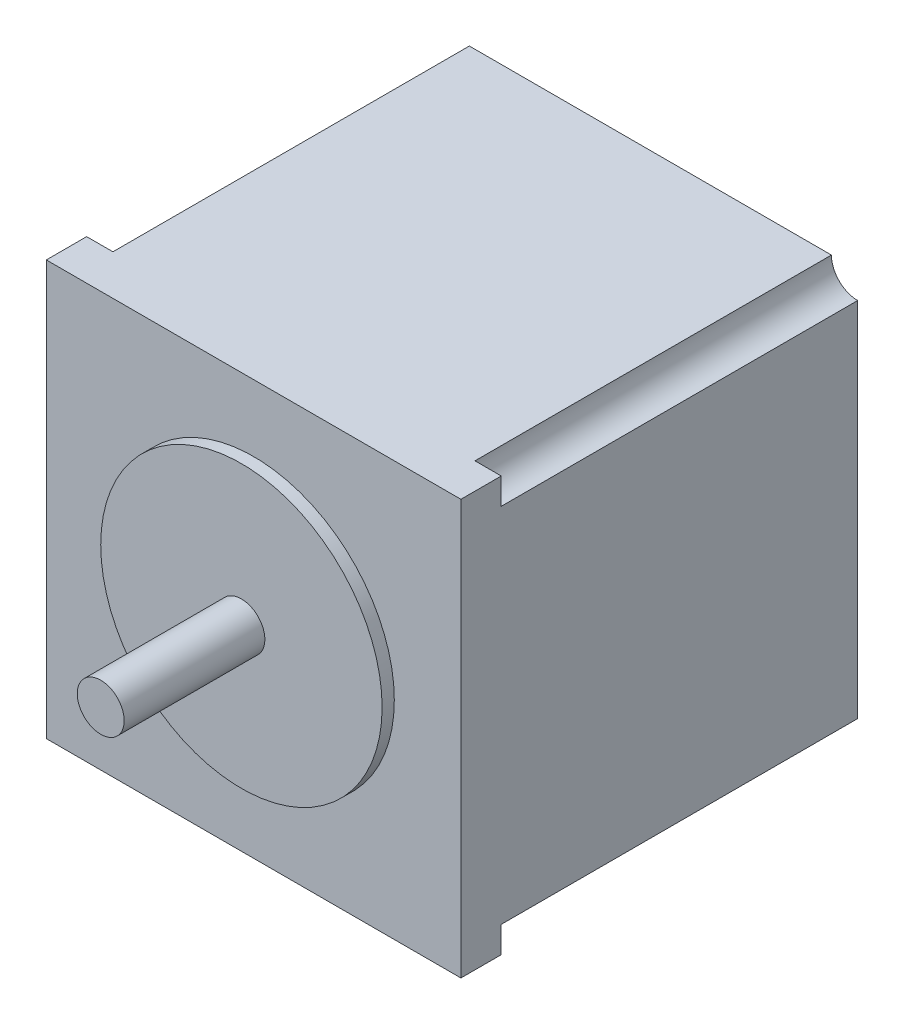
ISO-10303-21;
HEADER;
FILE_DESCRIPTION(('STEP AP214'),'2;1');
FILE_NAME('part.step','',(''),(''),'','','');
FILE_SCHEMA(('AUTOMOTIVE_DESIGN { 1 0 10303 214 1 1 1 1 }'));
ENDSEC;
DATA;
#1=APPLICATION_CONTEXT('core data for automotive mechanical design processes');
#2=APPLICATION_PROTOCOL_DEFINITION('international standard','automotive_design',2000,#1);
#3=PRODUCT_CONTEXT('',#1,'mechanical');
#4=PRODUCT('Part','Part','',(#3));
#5=PRODUCT_RELATED_PRODUCT_CATEGORY('part','',(#4));
#6=PRODUCT_DEFINITION_FORMATION('','',#4);
#7=PRODUCT_DEFINITION_CONTEXT('part definition',#1,'design');
#8=PRODUCT_DEFINITION('design','',#6,#7);
#9=PRODUCT_DEFINITION_SHAPE('','',#8);
#10=(LENGTH_UNIT() NAMED_UNIT(*) SI_UNIT(.MILLI.,.METRE.));
#11=(NAMED_UNIT(*) PLANE_ANGLE_UNIT() SI_UNIT($,.RADIAN.));
#12=(NAMED_UNIT(*) SI_UNIT($,.STERADIAN.) SOLID_ANGLE_UNIT());
#13=UNCERTAINTY_MEASURE_WITH_UNIT(LENGTH_MEASURE(1.E-05),#10,'distance_accuracy_value','');
#14=(GEOMETRIC_REPRESENTATION_CONTEXT(3) GLOBAL_UNCERTAINTY_ASSIGNED_CONTEXT((#13)) GLOBAL_UNIT_ASSIGNED_CONTEXT((#10,
#11,#12)) REPRESENTATION_CONTEXT('',''));
#15=CARTESIAN_POINT('',(0.,0.,0.));
#16=DIRECTION('',(0.,0.,1.));
#17=DIRECTION('',(1.,0.,0.));
#18=AXIS2_PLACEMENT_3D('',#15,#16,#17);
#19=CARTESIAN_POINT('',(0.,0.,0.));
#20=DIRECTION('',(0.,0.,-1.));
#21=DIRECTION('',(-1.,0.,0.));
#22=AXIS2_PLACEMENT_3D('',#19,#20,#21);
#23=PLANE('',#22);
#24=CARTESIAN_POINT('',(0.,56.134,0.));
#25=DIRECTION('',(0.,0.,1.));
#26=DIRECTION('',(-1.,0.,0.));
#27=AXIS2_PLACEMENT_3D('',#24,#25,#26);
#28=CIRCLE('',#27,3.556);
#29=CARTESIAN_POINT('',(0.,52.578,0.));
#30=VERTEX_POINT('',#29);
#31=CARTESIAN_POINT('',(3.556,56.134,0.));
#32=VERTEX_POINT('',#31);
#33=EDGE_CURVE('E157',#30,#32,#28,.T.);
#34=ORIENTED_EDGE('',*,*,#33,.F.);
#35=DIRECTION('',(0.,-1.,0.));
#36=VECTOR('',#35,1.);
#37=CARTESIAN_POINT('',(0.,0.,0.));
#38=LINE('',#37,#36);
#39=CARTESIAN_POINT('',(0.,56.134,0.));
#40=VERTEX_POINT('',#39);
#41=EDGE_CURVE('E188',#40,#30,#38,.T.);
#42=ORIENTED_EDGE('',*,*,#41,.F.);
#43=DIRECTION('',(-1.,0.,0.));
#44=VECTOR('',#43,1.);
#45=CARTESIAN_POINT('',(0.,56.134,0.));
#46=LINE('',#45,#44);
#47=EDGE_CURVE('E200',#32,#40,#46,.T.);
#48=ORIENTED_EDGE('',*,*,#47,.F.);
#49=EDGE_LOOP('',(#34,#42,#48));
#50=FACE_BOUND('',#49,.T.);
#51=ADVANCED_FACE('F39',(#50),#23,.T.);
#52=CARTESIAN_POINT('',(0.,0.,0.));
#53=DIRECTION('',(0.,0.,1.));
#54=DIRECTION('',(-1.,0.,0.));
#55=AXIS2_PLACEMENT_3D('',#52,#53,#54);
#56=CIRCLE('',#55,3.556);
#57=CARTESIAN_POINT('',(3.556,0.,0.));
#58=VERTEX_POINT('',#57);
#59=CARTESIAN_POINT('',(0.,3.556,0.));
#60=VERTEX_POINT('',#59);
#61=EDGE_CURVE('E65',#58,#60,#56,.T.);
#62=ORIENTED_EDGE('',*,*,#61,.F.);
#63=DIRECTION('',(1.,0.,0.));
#64=VECTOR('',#63,1.);
#65=CARTESIAN_POINT('',(0.,0.,0.));
#66=LINE('',#65,#64);
#67=CARTESIAN_POINT('',(0.,0.,0.));
#68=VERTEX_POINT('',#67);
#69=EDGE_CURVE('E192',#68,#58,#66,.T.);
#70=ORIENTED_EDGE('',*,*,#69,.F.);
#71=EDGE_CURVE('E164',#60,#68,#38,.T.);
#72=ORIENTED_EDGE('',*,*,#71,.F.);
#73=EDGE_LOOP('',(#62,#70,#72));
#74=FACE_BOUND('',#73,.T.);
#75=ADVANCED_FACE('F228',(#74),#23,.T.);
#76=CARTESIAN_POINT('',(56.134,0.,0.));
#77=DIRECTION('',(0.,0.,1.));
#78=DIRECTION('',(-1.,0.,0.));
#79=AXIS2_PLACEMENT_3D('',#76,#77,#78);
#80=CIRCLE('',#79,3.556);
#81=CARTESIAN_POINT('',(56.134,3.556,0.));
#82=VERTEX_POINT('',#81);
#83=CARTESIAN_POINT('',(52.578,0.,0.));
#84=VERTEX_POINT('',#83);
#85=EDGE_CURVE('E263',#82,#84,#80,.T.);
#86=ORIENTED_EDGE('',*,*,#85,.F.);
#87=DIRECTION('',(0.,1.,0.));
#88=VECTOR('',#87,1.);
#89=CARTESIAN_POINT('',(56.134,0.,0.));
#90=LINE('',#89,#88);
#91=CARTESIAN_POINT('',(56.134,0.,0.));
#92=VERTEX_POINT('',#91);
#93=EDGE_CURVE('E196',#92,#82,#90,.T.);
#94=ORIENTED_EDGE('',*,*,#93,.F.);
#95=EDGE_CURVE('E57',#84,#92,#66,.T.);
#96=ORIENTED_EDGE('',*,*,#95,.F.);
#97=EDGE_LOOP('',(#86,#94,#96));
#98=FACE_BOUND('',#97,.T.);
#99=ADVANCED_FACE('F230',(#98),#23,.T.);
#100=CARTESIAN_POINT('',(56.134,56.134,0.));
#101=DIRECTION('',(0.,0.,1.));
#102=DIRECTION('',(-1.,0.,0.));
#103=AXIS2_PLACEMENT_3D('',#100,#101,#102);
#104=CIRCLE('',#103,3.556);
#105=CARTESIAN_POINT('',(52.578,56.134,0.));
#106=VERTEX_POINT('',#105);
#107=CARTESIAN_POINT('',(56.134,52.578,0.));
#108=VERTEX_POINT('',#107);
#109=EDGE_CURVE('E258',#106,#108,#104,.T.);
#110=ORIENTED_EDGE('',*,*,#109,.F.);
#111=CARTESIAN_POINT('',(56.134,56.134,0.));
#112=VERTEX_POINT('',#111);
#113=EDGE_CURVE('E178',#112,#106,#46,.T.);
#114=ORIENTED_EDGE('',*,*,#113,.F.);
#115=EDGE_CURVE('E195',#108,#112,#90,.T.);
#116=ORIENTED_EDGE('',*,*,#115,.F.);
#117=EDGE_LOOP('',(#110,#114,#116));
#118=FACE_BOUND('',#117,.T.);
#119=ADVANCED_FACE('F236',(#118),#23,.T.);
#120=CARTESIAN_POINT('',(0.,0.,5.461));
#121=DIRECTION('',(1.,0.,0.));
#122=DIRECTION('',(0.,0.,-1.));
#123=AXIS2_PLACEMENT_3D('',#120,#121,#122);
#124=PLANE('',#123);
#125=ORIENTED_EDGE('',*,*,#41,.T.);
#126=DIRECTION('',(0.,0.,1.));
#127=VECTOR('',#126,1.);
#128=CARTESIAN_POINT('',(0.,52.578,-48.26));
#129=LINE('',#128,#127);
#130=CARTESIAN_POINT('',(0.,52.578,-48.26));
#131=VERTEX_POINT('',#130);
#132=EDGE_CURVE('E286',#131,#30,#129,.T.);
#133=ORIENTED_EDGE('',*,*,#132,.F.);
#134=DIRECTION('',(0.,1.,0.));
#135=VECTOR('',#134,1.);
#136=CARTESIAN_POINT('',(0.,52.578,-48.26));
#137=LINE('',#136,#135);
#138=CARTESIAN_POINT('',(0.,3.556,-48.26));
#139=VERTEX_POINT('',#138);
#140=EDGE_CURVE('E150',#139,#131,#137,.T.);
#141=ORIENTED_EDGE('',*,*,#140,.F.);
#142=DIRECTION('',(0.,0.,1.));
#143=VECTOR('',#142,1.);
#144=CARTESIAN_POINT('',(0.,3.556,-48.26));
#145=LINE('',#144,#143);
#146=EDGE_CURVE('E226',#139,#60,#145,.T.);
#147=ORIENTED_EDGE('',*,*,#146,.T.);
#148=ORIENTED_EDGE('',*,*,#71,.T.);
#149=DIRECTION('',(0.,0.,-1.));
#150=VECTOR('',#149,1.);
#151=CARTESIAN_POINT('',(0.,0.,5.461));
#152=LINE('',#151,#150);
#153=CARTESIAN_POINT('',(0.,0.,5.461));
#154=VERTEX_POINT('',#153);
#155=EDGE_CURVE('E43',#154,#68,#152,.T.);
#156=ORIENTED_EDGE('',*,*,#155,.F.);
#157=DIRECTION('',(0.,-1.,0.));
#158=VECTOR('',#157,1.);
#159=CARTESIAN_POINT('',(0.,0.,5.461));
#160=LINE('',#159,#158);
#161=CARTESIAN_POINT('',(0.,56.134,5.461));
#162=VERTEX_POINT('',#161);
#163=EDGE_CURVE('E173',#162,#154,#160,.T.);
#164=ORIENTED_EDGE('',*,*,#163,.F.);
#165=DIRECTION('',(0.,0.,-1.));
#166=VECTOR('',#165,1.);
#167=CARTESIAN_POINT('',(0.,56.134,5.461));
#168=LINE('',#167,#166);
#169=EDGE_CURVE('E187',#162,#40,#168,.T.);
#170=ORIENTED_EDGE('',*,*,#169,.T.);
#171=EDGE_LOOP('',(#125,#133,#141,#147,#148,#156,#164,#170));
#172=FACE_BOUND('',#171,.T.);
#173=ADVANCED_FACE('F41',(#172),#124,.F.);
#174=CARTESIAN_POINT('',(0.,0.,5.461));
#175=DIRECTION('',(0.,1.,0.));
#176=DIRECTION('',(0.,0.,1.));
#177=AXIS2_PLACEMENT_3D('',#174,#175,#176);
#178=PLANE('',#177);
#179=ORIENTED_EDGE('',*,*,#69,.T.);
#180=DIRECTION('',(0.,0.,1.));
#181=VECTOR('',#180,1.);
#182=CARTESIAN_POINT('',(3.556,0.,-48.26));
#183=LINE('',#182,#181);
#184=CARTESIAN_POINT('',(3.556,0.,-48.26));
#185=VERTEX_POINT('',#184);
#186=EDGE_CURVE('E298',#185,#58,#183,.T.);
#187=ORIENTED_EDGE('',*,*,#186,.F.);
#188=DIRECTION('',(-1.,0.,0.));
#189=VECTOR('',#188,1.);
#190=CARTESIAN_POINT('',(52.578,0.,-48.26));
#191=LINE('',#190,#189);
#192=CARTESIAN_POINT('',(52.578,0.,-48.26));
#193=VERTEX_POINT('',#192);
#194=EDGE_CURVE('E278',#193,#185,#191,.T.);
#195=ORIENTED_EDGE('',*,*,#194,.F.);
#196=DIRECTION('',(0.,0.,1.));
#197=VECTOR('',#196,1.);
#198=CARTESIAN_POINT('',(52.578,0.,-48.26));
#199=LINE('',#198,#197);
#200=EDGE_CURVE('E301',#193,#84,#199,.T.);
#201=ORIENTED_EDGE('',*,*,#200,.T.);
#202=ORIENTED_EDGE('',*,*,#95,.T.);
#203=DIRECTION('',(0.,0.,-1.));
#204=VECTOR('',#203,1.);
#205=CARTESIAN_POINT('',(56.134,0.,5.461));
#206=LINE('',#205,#204);
#207=CARTESIAN_POINT('',(56.134,0.,5.461));
#208=VERTEX_POINT('',#207);
#209=EDGE_CURVE('E209',#208,#92,#206,.T.);
#210=ORIENTED_EDGE('',*,*,#209,.F.);
#211=DIRECTION('',(1.,0.,0.));
#212=VECTOR('',#211,1.);
#213=CARTESIAN_POINT('',(0.,0.,5.461));
#214=LINE('',#213,#212);
#215=EDGE_CURVE('E177',#154,#208,#214,.T.);
#216=ORIENTED_EDGE('',*,*,#215,.F.);
#217=ORIENTED_EDGE('',*,*,#155,.T.);
#218=EDGE_LOOP('',(#179,#187,#195,#201,#202,#210,#216,#217));
#219=FACE_BOUND('',#218,.T.);
#220=ADVANCED_FACE('F219',(#219),#178,.F.);
#221=CARTESIAN_POINT('',(56.134,0.,5.461));
#222=DIRECTION('',(-1.,0.,0.));
#223=DIRECTION('',(0.,0.,1.));
#224=AXIS2_PLACEMENT_3D('',#221,#222,#223);
#225=PLANE('',#224);
#226=ORIENTED_EDGE('',*,*,#93,.T.);
#227=DIRECTION('',(0.,0.,1.));
#228=VECTOR('',#227,1.);
#229=CARTESIAN_POINT('',(56.134,3.556,-48.26));
#230=LINE('',#229,#228);
#231=CARTESIAN_POINT('',(56.134,3.556,-48.26));
#232=VERTEX_POINT('',#231);
#233=EDGE_CURVE('E305',#232,#82,#230,.T.);
#234=ORIENTED_EDGE('',*,*,#233,.F.);
#235=DIRECTION('',(0.,-1.,0.));
#236=VECTOR('',#235,1.);
#237=CARTESIAN_POINT('',(56.134,52.578,-48.26));
#238=LINE('',#237,#236);
#239=CARTESIAN_POINT('',(56.134,52.578,-48.26));
#240=VERTEX_POINT('',#239);
#241=EDGE_CURVE('E270',#240,#232,#238,.T.);
#242=ORIENTED_EDGE('',*,*,#241,.F.);
#243=DIRECTION('',(0.,0.,1.));
#244=VECTOR('',#243,1.);
#245=CARTESIAN_POINT('',(56.134,52.578,-48.26));
#246=LINE('',#245,#244);
#247=EDGE_CURVE('E166',#240,#108,#246,.T.);
#248=ORIENTED_EDGE('',*,*,#247,.T.);
#249=ORIENTED_EDGE('',*,*,#115,.T.);
#250=DIRECTION('',(0.,0.,-1.));
#251=VECTOR('',#250,1.);
#252=CARTESIAN_POINT('',(56.134,56.134,5.461));
#253=LINE('',#252,#251);
#254=CARTESIAN_POINT('',(56.134,56.134,5.461));
#255=VERTEX_POINT('',#254);
#256=EDGE_CURVE('E206',#255,#112,#253,.T.);
#257=ORIENTED_EDGE('',*,*,#256,.F.);
#258=DIRECTION('',(0.,1.,0.));
#259=VECTOR('',#258,1.);
#260=CARTESIAN_POINT('',(56.134,0.,5.461));
#261=LINE('',#260,#259);
#262=EDGE_CURVE('E181',#208,#255,#261,.T.);
#263=ORIENTED_EDGE('',*,*,#262,.F.);
#264=ORIENTED_EDGE('',*,*,#209,.T.);
#265=EDGE_LOOP('',(#226,#234,#242,#248,#249,#257,#263,#264));
#266=FACE_BOUND('',#265,.T.);
#267=ADVANCED_FACE('F244',(#266),#225,.F.);
#268=CARTESIAN_POINT('',(0.,56.134,5.461));
#269=DIRECTION('',(0.,-1.,0.));
#270=DIRECTION('',(0.,0.,-1.));
#271=AXIS2_PLACEMENT_3D('',#268,#269,#270);
#272=PLANE('',#271);
#273=ORIENTED_EDGE('',*,*,#113,.T.);
#274=DIRECTION('',(0.,0.,1.));
#275=VECTOR('',#274,1.);
#276=CARTESIAN_POINT('',(52.578,56.134,-48.26));
#277=LINE('',#276,#275);
#278=CARTESIAN_POINT('',(52.578,56.134,-48.26));
#279=VERTEX_POINT('',#278);
#280=EDGE_CURVE('E140',#279,#106,#277,.T.);
#281=ORIENTED_EDGE('',*,*,#280,.F.);
#282=DIRECTION('',(1.,0.,0.));
#283=VECTOR('',#282,1.);
#284=CARTESIAN_POINT('',(52.578,56.134,-48.26));
#285=LINE('',#284,#283);
#286=CARTESIAN_POINT('',(3.556,56.134,-48.26));
#287=VERTEX_POINT('',#286);
#288=EDGE_CURVE('E132',#287,#279,#285,.T.);
#289=ORIENTED_EDGE('',*,*,#288,.F.);
#290=DIRECTION('',(0.,0.,1.));
#291=VECTOR('',#290,1.);
#292=CARTESIAN_POINT('',(3.556,56.134,-48.26));
#293=LINE('',#292,#291);
#294=EDGE_CURVE('E137',#287,#32,#293,.T.);
#295=ORIENTED_EDGE('',*,*,#294,.T.);
#296=ORIENTED_EDGE('',*,*,#47,.T.);
#297=ORIENTED_EDGE('',*,*,#169,.F.);
#298=DIRECTION('',(-1.,0.,0.));
#299=VECTOR('',#298,1.);
#300=CARTESIAN_POINT('',(0.,56.134,5.461));
#301=LINE('',#300,#299);
#302=EDGE_CURVE('E184',#255,#162,#301,.T.);
#303=ORIENTED_EDGE('',*,*,#302,.F.);
#304=ORIENTED_EDGE('',*,*,#256,.T.);
#305=EDGE_LOOP('',(#273,#281,#289,#295,#296,#297,#303,#304));
#306=FACE_BOUND('',#305,.T.);
#307=ADVANCED_FACE('F135',(#306),#272,.F.);
#308=CARTESIAN_POINT('',(0.,0.,5.461));
#309=DIRECTION('',(0.,0.,-1.));
#310=DIRECTION('',(-1.,0.,0.));
#311=AXIS2_PLACEMENT_3D('',#308,#309,#310);
#312=PLANE('',#311);
#313=CARTESIAN_POINT('',(28.067,28.067,5.461));
#314=DIRECTION('',(0.,0.,1.));
#315=DIRECTION('',(1.,0.,0.));
#316=AXIS2_PLACEMENT_3D('',#313,#314,#315);
#317=CIRCLE('',#316,19.05);
#318=CARTESIAN_POINT('',(47.117,28.067,5.461));
#319=VERTEX_POINT('',#318);
#320=EDGE_CURVE('E49',#319,#319,#317,.T.);
#321=ORIENTED_EDGE('',*,*,#320,.F.);
#322=EDGE_LOOP('',(#321));
#323=FACE_BOUND('',#322,.T.);
#324=ORIENTED_EDGE('',*,*,#163,.T.);
#325=ORIENTED_EDGE('',*,*,#215,.T.);
#326=ORIENTED_EDGE('',*,*,#262,.T.);
#327=ORIENTED_EDGE('',*,*,#302,.T.);
#328=EDGE_LOOP('',(#324,#325,#326,#327));
#329=FACE_BOUND('',#328,.T.);
#330=ADVANCED_FACE('F240',(#323,#329),#312,.F.);
#331=CARTESIAN_POINT('',(28.067,28.067,7.112));
#332=DIRECTION('',(0.,0.,-1.));
#333=DIRECTION('',(-1.,0.,0.));
#334=AXIS2_PLACEMENT_3D('',#331,#332,#333);
#335=CYLINDRICAL_SURFACE('',#334,19.05);
#336=CARTESIAN_POINT('',(28.067,28.067,7.112));
#337=DIRECTION('',(0.,0.,1.));
#338=DIRECTION('',(1.,0.,0.));
#339=AXIS2_PLACEMENT_3D('',#336,#337,#338);
#340=CIRCLE('',#339,19.05);
#341=CARTESIAN_POINT('',(47.117,28.067,7.112));
#342=VERTEX_POINT('',#341);
#343=EDGE_CURVE('E159',#342,#342,#340,.T.);
#344=ORIENTED_EDGE('',*,*,#343,.F.);
#345=EDGE_LOOP('',(#344));
#346=FACE_BOUND('',#345,.T.);
#347=ORIENTED_EDGE('',*,*,#320,.T.);
#348=EDGE_LOOP('',(#347));
#349=FACE_BOUND('',#348,.T.);
#350=ADVANCED_FACE('F325',(#346,#349),#335,.T.);
#351=CARTESIAN_POINT('',(28.067,28.067,7.112));
#352=DIRECTION('',(0.,0.,1.));
#353=DIRECTION('',(1.,0.,0.));
#354=AXIS2_PLACEMENT_3D('',#351,#352,#353);
#355=PLANE('',#354);
#356=CARTESIAN_POINT('',(28.067,28.067,7.112));
#357=DIRECTION('',(0.,0.,1.));
#358=DIRECTION('',(1.,0.,0.));
#359=AXIS2_PLACEMENT_3D('',#356,#357,#358);
#360=CIRCLE('',#359,3.175);
#361=CARTESIAN_POINT('',(31.242,28.067,7.112));
#362=VERTEX_POINT('',#361);
#363=EDGE_CURVE('E11',#362,#362,#360,.T.);
#364=ORIENTED_EDGE('',*,*,#363,.F.);
#365=EDGE_LOOP('',(#364));
#366=FACE_BOUND('',#365,.T.);
#367=ORIENTED_EDGE('',*,*,#343,.T.);
#368=EDGE_LOOP('',(#367));
#369=FACE_BOUND('',#368,.T.);
#370=ADVANCED_FACE('F330',(#366,#369),#355,.T.);
#371=CARTESIAN_POINT('',(0.,56.134,-48.26));
#372=DIRECTION('',(0.,0.,1.));
#373=DIRECTION('',(1.,0.,0.));
#374=AXIS2_PLACEMENT_3D('',#371,#372,#373);
#375=CYLINDRICAL_SURFACE('',#374,3.556);
#376=ORIENTED_EDGE('',*,*,#33,.T.);
#377=ORIENTED_EDGE('',*,*,#294,.F.);
#378=CARTESIAN_POINT('',(0.,56.134,-48.26));
#379=DIRECTION('',(0.,0.,1.));
#380=DIRECTION('',(-1.,0.,0.));
#381=AXIS2_PLACEMENT_3D('',#378,#379,#380);
#382=CIRCLE('',#381,3.556);
#383=EDGE_CURVE('E145',#131,#287,#382,.T.);
#384=ORIENTED_EDGE('',*,*,#383,.F.);
#385=ORIENTED_EDGE('',*,*,#132,.T.);
#386=EDGE_LOOP('',(#376,#377,#384,#385));
#387=FACE_BOUND('',#386,.T.);
#388=ADVANCED_FACE('F156',(#387),#375,.F.);
#389=CARTESIAN_POINT('',(56.134,56.134,-48.26));
#390=DIRECTION('',(0.,0.,1.));
#391=DIRECTION('',(1.,0.,0.));
#392=AXIS2_PLACEMENT_3D('',#389,#390,#391);
#393=CYLINDRICAL_SURFACE('',#392,3.556);
#394=ORIENTED_EDGE('',*,*,#109,.T.);
#395=ORIENTED_EDGE('',*,*,#247,.F.);
#396=CARTESIAN_POINT('',(56.134,56.134,-48.26));
#397=DIRECTION('',(0.,0.,1.));
#398=DIRECTION('',(-1.,0.,0.));
#399=AXIS2_PLACEMENT_3D('',#396,#397,#398);
#400=CIRCLE('',#399,3.556);
#401=EDGE_CURVE('E144',#279,#240,#400,.T.);
#402=ORIENTED_EDGE('',*,*,#401,.F.);
#403=ORIENTED_EDGE('',*,*,#280,.T.);
#404=EDGE_LOOP('',(#394,#395,#402,#403));
#405=FACE_BOUND('',#404,.T.);
#406=ADVANCED_FACE('F267',(#405),#393,.F.);
#407=CARTESIAN_POINT('',(56.134,0.,-48.26));
#408=DIRECTION('',(0.,0.,1.));
#409=DIRECTION('',(1.,0.,0.));
#410=AXIS2_PLACEMENT_3D('',#407,#408,#409);
#411=CYLINDRICAL_SURFACE('',#410,3.556);
#412=ORIENTED_EDGE('',*,*,#85,.T.);
#413=ORIENTED_EDGE('',*,*,#200,.F.);
#414=CARTESIAN_POINT('',(56.134,0.,-48.26));
#415=DIRECTION('',(0.,0.,1.));
#416=DIRECTION('',(-1.,0.,0.));
#417=AXIS2_PLACEMENT_3D('',#414,#415,#416);
#418=CIRCLE('',#417,3.556);
#419=EDGE_CURVE('E273',#232,#193,#418,.T.);
#420=ORIENTED_EDGE('',*,*,#419,.F.);
#421=ORIENTED_EDGE('',*,*,#233,.T.);
#422=EDGE_LOOP('',(#412,#413,#420,#421));
#423=FACE_BOUND('',#422,.T.);
#424=ADVANCED_FACE('F314',(#423),#411,.F.);
#425=CARTESIAN_POINT('',(0.,0.,-48.26));
#426=DIRECTION('',(0.,0.,1.));
#427=DIRECTION('',(1.,0.,0.));
#428=AXIS2_PLACEMENT_3D('',#425,#426,#427);
#429=CYLINDRICAL_SURFACE('',#428,3.556);
#430=ORIENTED_EDGE('',*,*,#61,.T.);
#431=ORIENTED_EDGE('',*,*,#146,.F.);
#432=CARTESIAN_POINT('',(0.,0.,-48.26));
#433=DIRECTION('',(0.,0.,1.));
#434=DIRECTION('',(-1.,0.,0.));
#435=AXIS2_PLACEMENT_3D('',#432,#433,#434);
#436=CIRCLE('',#435,3.556);
#437=EDGE_CURVE('E281',#185,#139,#436,.T.);
#438=ORIENTED_EDGE('',*,*,#437,.F.);
#439=ORIENTED_EDGE('',*,*,#186,.T.);
#440=EDGE_LOOP('',(#430,#431,#438,#439));
#441=FACE_BOUND('',#440,.T.);
#442=ADVANCED_FACE('F317',(#441),#429,.F.);
#443=CARTESIAN_POINT('',(0.,56.134,-48.26));
#444=DIRECTION('',(0.,0.,-1.));
#445=DIRECTION('',(-1.,0.,0.));
#446=AXIS2_PLACEMENT_3D('',#443,#444,#445);
#447=PLANE('',#446);
#448=ORIENTED_EDGE('',*,*,#383,.T.);
#449=ORIENTED_EDGE('',*,*,#288,.T.);
#450=ORIENTED_EDGE('',*,*,#401,.T.);
#451=ORIENTED_EDGE('',*,*,#241,.T.);
#452=ORIENTED_EDGE('',*,*,#419,.T.);
#453=ORIENTED_EDGE('',*,*,#194,.T.);
#454=ORIENTED_EDGE('',*,*,#437,.T.);
#455=ORIENTED_EDGE('',*,*,#140,.T.);
#456=EDGE_LOOP('',(#448,#449,#450,#451,#452,#453,#454,#455));
#457=FACE_BOUND('',#456,.T.);
#458=ADVANCED_FACE('F148',(#457),#447,.T.);
#459=CARTESIAN_POINT('',(28.067,28.067,26.162));
#460=DIRECTION('',(0.,0.,-1.));
#461=DIRECTION('',(-1.,0.,0.));
#462=AXIS2_PLACEMENT_3D('',#459,#460,#461);
#463=CYLINDRICAL_SURFACE('',#462,3.175);
#464=CARTESIAN_POINT('',(28.067,28.067,26.162));
#465=DIRECTION('',(0.,0.,1.));
#466=DIRECTION('',(1.,0.,0.));
#467=AXIS2_PLACEMENT_3D('',#464,#465,#466);
#468=CIRCLE('',#467,3.175);
#469=CARTESIAN_POINT('',(31.242,28.067,26.162));
#470=VERTEX_POINT('',#469);
#471=EDGE_CURVE('E288',#470,#470,#468,.T.);
#472=ORIENTED_EDGE('',*,*,#471,.F.);
#473=EDGE_LOOP('',(#472));
#474=FACE_BOUND('',#473,.T.);
#475=ORIENTED_EDGE('',*,*,#363,.T.);
#476=EDGE_LOOP('',(#475));
#477=FACE_BOUND('',#476,.T.);
#478=ADVANCED_FACE('F351',(#474,#477),#463,.T.);
#479=CARTESIAN_POINT('',(28.067,28.067,26.162));
#480=DIRECTION('',(0.,0.,1.));
#481=DIRECTION('',(1.,0.,0.));
#482=AXIS2_PLACEMENT_3D('',#479,#480,#481);
#483=PLANE('',#482);
#484=ORIENTED_EDGE('',*,*,#471,.T.);
#485=EDGE_LOOP('',(#484));
#486=FACE_BOUND('',#485,.T.);
#487=ADVANCED_FACE('F354',(#486),#483,.T.);
#488=CLOSED_SHELL('',(#51,#75,#99,#119,#173,#220,#267,#307,#330,#350,#370,#388,#406,#424,#442,
#458,#478,#487));
#489=MANIFOLD_SOLID_BREP('B2',#488);
#490=ADVANCED_BREP_SHAPE_REPRESENTATION('',(#18,#489),#14);
#491=SHAPE_DEFINITION_REPRESENTATION(#9,#490);
ENDSEC;
END-ISO-10303-21;
